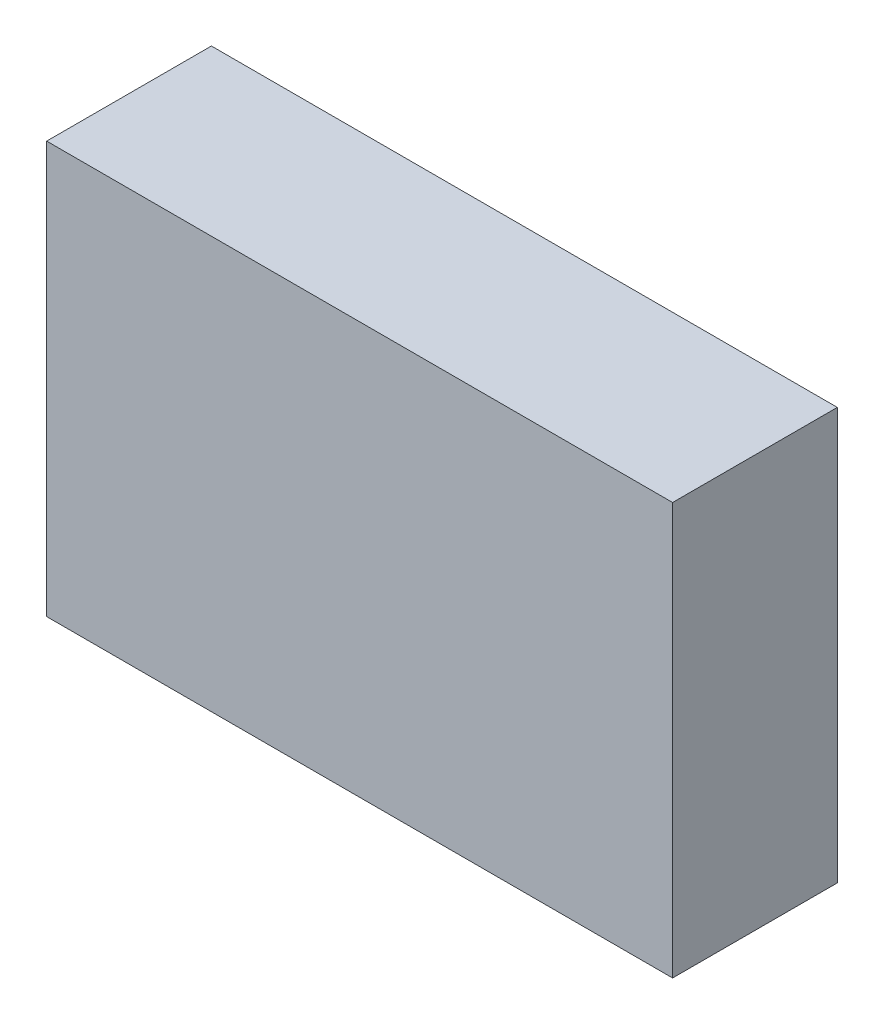
ISO-10303-21;
HEADER;
FILE_DESCRIPTION(('STEP AP214'),'2;1');
FILE_NAME('part.step','',(''),(''),'','','');
FILE_SCHEMA(('AUTOMOTIVE_DESIGN { 1 0 10303 214 1 1 1 1 }'));
ENDSEC;
DATA;
#1=APPLICATION_CONTEXT('core data for automotive mechanical design processes');
#2=APPLICATION_PROTOCOL_DEFINITION('international standard','automotive_design',2000,#1);
#3=PRODUCT_CONTEXT('',#1,'mechanical');
#4=PRODUCT('Part','Part','',(#3));
#5=PRODUCT_RELATED_PRODUCT_CATEGORY('part','',(#4));
#6=PRODUCT_DEFINITION_FORMATION('','',#4);
#7=PRODUCT_DEFINITION_CONTEXT('part definition',#1,'design');
#8=PRODUCT_DEFINITION('design','',#6,#7);
#9=PRODUCT_DEFINITION_SHAPE('','',#8);
#10=(LENGTH_UNIT() NAMED_UNIT(*) SI_UNIT(.MILLI.,.METRE.));
#11=(NAMED_UNIT(*) PLANE_ANGLE_UNIT() SI_UNIT($,.RADIAN.));
#12=(NAMED_UNIT(*) SI_UNIT($,.STERADIAN.) SOLID_ANGLE_UNIT());
#13=UNCERTAINTY_MEASURE_WITH_UNIT(LENGTH_MEASURE(1.E-05),#10,'distance_accuracy_value','');
#14=(GEOMETRIC_REPRESENTATION_CONTEXT(3) GLOBAL_UNCERTAINTY_ASSIGNED_CONTEXT((#13)) GLOBAL_UNIT_ASSIGNED_CONTEXT((#10,
#11,#12)) REPRESENTATION_CONTEXT('',''));
#15=CARTESIAN_POINT('',(0.,0.,0.));
#16=DIRECTION('',(0.,0.,1.));
#17=DIRECTION('',(1.,0.,0.));
#18=AXIS2_PLACEMENT_3D('',#15,#16,#17);
#19=CARTESIAN_POINT('',(0.,0.,0.5));
#20=DIRECTION('',(1.,0.,0.));
#21=DIRECTION('',(0.,0.,-1.));
#22=AXIS2_PLACEMENT_3D('',#19,#20,#21);
#23=PLANE('',#22);
#24=DIRECTION('',(0.,-1.,0.));
#25=VECTOR('',#24,1.);
#26=CARTESIAN_POINT('',(0.,1.25,0.));
#27=LINE('',#26,#25);
#28=CARTESIAN_POINT('',(0.,1.25,0.));
#29=VERTEX_POINT('',#28);
#30=CARTESIAN_POINT('',(0.,0.,0.));
#31=VERTEX_POINT('',#30);
#32=EDGE_CURVE('E11',#29,#31,#27,.T.);
#33=ORIENTED_EDGE('',*,*,#32,.T.);
#34=DIRECTION('',(0.,0.,-1.));
#35=VECTOR('',#34,1.);
#36=CARTESIAN_POINT('',(0.,0.,0.5));
#37=LINE('',#36,#35);
#38=CARTESIAN_POINT('',(0.,0.,0.5));
#39=VERTEX_POINT('',#38);
#40=EDGE_CURVE('E88',#39,#31,#37,.T.);
#41=ORIENTED_EDGE('',*,*,#40,.F.);
#42=DIRECTION('',(0.,-1.,0.));
#43=VECTOR('',#42,1.);
#44=CARTESIAN_POINT('',(0.,1.25,0.5));
#45=LINE('',#44,#43);
#46=CARTESIAN_POINT('',(0.,1.25,0.5));
#47=VERTEX_POINT('',#46);
#48=EDGE_CURVE('E83',#47,#39,#45,.T.);
#49=ORIENTED_EDGE('',*,*,#48,.F.);
#50=DIRECTION('',(0.,0.,-1.));
#51=VECTOR('',#50,1.);
#52=CARTESIAN_POINT('',(0.,1.25,0.5));
#53=LINE('',#52,#51);
#54=EDGE_CURVE('E72',#47,#29,#53,.T.);
#55=ORIENTED_EDGE('',*,*,#54,.T.);
#56=EDGE_LOOP('',(#33,#41,#49,#55));
#57=FACE_BOUND('',#56,.T.);
#58=ADVANCED_FACE('F17',(#57),#23,.F.);
#59=CARTESIAN_POINT('',(0.,0.,0.5));
#60=DIRECTION('',(0.,1.,0.));
#61=DIRECTION('',(0.,0.,1.));
#62=AXIS2_PLACEMENT_3D('',#59,#60,#61);
#63=PLANE('',#62);
#64=DIRECTION('',(1.,0.,0.));
#65=VECTOR('',#64,1.);
#66=CARTESIAN_POINT('',(0.,0.,0.));
#67=LINE('',#66,#65);
#68=CARTESIAN_POINT('',(1.9,0.,0.));
#69=VERTEX_POINT('',#68);
#70=EDGE_CURVE('E24',#31,#69,#67,.T.);
#71=ORIENTED_EDGE('',*,*,#70,.T.);
#72=DIRECTION('',(0.,0.,-1.));
#73=VECTOR('',#72,1.);
#74=CARTESIAN_POINT('',(1.9,0.,0.5));
#75=LINE('',#74,#73);
#76=CARTESIAN_POINT('',(1.9,0.,0.5));
#77=VERTEX_POINT('',#76);
#78=EDGE_CURVE('E85',#77,#69,#75,.T.);
#79=ORIENTED_EDGE('',*,*,#78,.F.);
#80=DIRECTION('',(1.,0.,0.));
#81=VECTOR('',#80,1.);
#82=CARTESIAN_POINT('',(0.,0.,0.5));
#83=LINE('',#82,#81);
#84=EDGE_CURVE('E66',#39,#77,#83,.T.);
#85=ORIENTED_EDGE('',*,*,#84,.F.);
#86=ORIENTED_EDGE('',*,*,#40,.T.);
#87=EDGE_LOOP('',(#71,#79,#85,#86));
#88=FACE_BOUND('',#87,.T.);
#89=ADVANCED_FACE('F89',(#88),#63,.F.);
#90=CARTESIAN_POINT('',(1.9,0.,0.5));
#91=DIRECTION('',(-1.,0.,0.));
#92=DIRECTION('',(0.,0.,1.));
#93=AXIS2_PLACEMENT_3D('',#90,#91,#92);
#94=PLANE('',#93);
#95=DIRECTION('',(0.,1.,0.));
#96=VECTOR('',#95,1.);
#97=CARTESIAN_POINT('',(1.9,0.,0.));
#98=LINE('',#97,#96);
#99=CARTESIAN_POINT('',(1.9,1.25,0.));
#100=VERTEX_POINT('',#99);
#101=EDGE_CURVE('E62',#69,#100,#98,.T.);
#102=ORIENTED_EDGE('',*,*,#101,.T.);
#103=DIRECTION('',(0.,0.,-1.));
#104=VECTOR('',#103,1.);
#105=CARTESIAN_POINT('',(1.9,1.25,0.5));
#106=LINE('',#105,#104);
#107=CARTESIAN_POINT('',(1.9,1.25,0.5));
#108=VERTEX_POINT('',#107);
#109=EDGE_CURVE('E55',#108,#100,#106,.T.);
#110=ORIENTED_EDGE('',*,*,#109,.F.);
#111=DIRECTION('',(0.,1.,0.));
#112=VECTOR('',#111,1.);
#113=CARTESIAN_POINT('',(1.9,0.,0.5));
#114=LINE('',#113,#112);
#115=EDGE_CURVE('E59',#77,#108,#114,.T.);
#116=ORIENTED_EDGE('',*,*,#115,.F.);
#117=ORIENTED_EDGE('',*,*,#78,.T.);
#118=EDGE_LOOP('',(#102,#110,#116,#117));
#119=FACE_BOUND('',#118,.T.);
#120=ADVANCED_FACE('F57',(#119),#94,.F.);
#121=CARTESIAN_POINT('',(0.,1.25,0.5));
#122=DIRECTION('',(0.,-1.,0.));
#123=DIRECTION('',(0.,0.,-1.));
#124=AXIS2_PLACEMENT_3D('',#121,#122,#123);
#125=PLANE('',#124);
#126=DIRECTION('',(-1.,0.,0.));
#127=VECTOR('',#126,1.);
#128=CARTESIAN_POINT('',(1.9,1.25,0.));
#129=LINE('',#128,#127);
#130=EDGE_CURVE('E65',#100,#29,#129,.T.);
#131=ORIENTED_EDGE('',*,*,#130,.T.);
#132=ORIENTED_EDGE('',*,*,#54,.F.);
#133=DIRECTION('',(-1.,0.,0.));
#134=VECTOR('',#133,1.);
#135=CARTESIAN_POINT('',(1.9,1.25,0.5));
#136=LINE('',#135,#134);
#137=EDGE_CURVE('E70',#108,#47,#136,.T.);
#138=ORIENTED_EDGE('',*,*,#137,.F.);
#139=ORIENTED_EDGE('',*,*,#109,.T.);
#140=EDGE_LOOP('',(#131,#132,#138,#139));
#141=FACE_BOUND('',#140,.T.);
#142=ADVANCED_FACE('F71',(#141),#125,.F.);
#143=CARTESIAN_POINT('',(0.,0.,0.5));
#144=DIRECTION('',(0.,0.,-1.));
#145=DIRECTION('',(-1.,0.,0.));
#146=AXIS2_PLACEMENT_3D('',#143,#144,#145);
#147=PLANE('',#146);
#148=ORIENTED_EDGE('',*,*,#48,.T.);
#149=ORIENTED_EDGE('',*,*,#84,.T.);
#150=ORIENTED_EDGE('',*,*,#115,.T.);
#151=ORIENTED_EDGE('',*,*,#137,.T.);
#152=EDGE_LOOP('',(#148,#149,#150,#151));
#153=FACE_BOUND('',#152,.T.);
#154=ADVANCED_FACE('F76',(#153),#147,.F.);
#155=CARTESIAN_POINT('',(0.,0.,0.));
#156=DIRECTION('',(0.,0.,-1.));
#157=DIRECTION('',(-1.,0.,0.));
#158=AXIS2_PLACEMENT_3D('',#155,#156,#157);
#159=PLANE('',#158);
#160=ORIENTED_EDGE('',*,*,#32,.F.);
#161=ORIENTED_EDGE('',*,*,#130,.F.);
#162=ORIENTED_EDGE('',*,*,#101,.F.);
#163=ORIENTED_EDGE('',*,*,#70,.F.);
#164=EDGE_LOOP('',(#160,#161,#162,#163));
#165=FACE_BOUND('',#164,.T.);
#166=ADVANCED_FACE('F91',(#165),#159,.T.);
#167=CLOSED_SHELL('',(#58,#89,#120,#142,#154,#166));
#168=MANIFOLD_SOLID_BREP('B1',#167);
#169=ADVANCED_BREP_SHAPE_REPRESENTATION('',(#18,#168),#14);
#170=SHAPE_DEFINITION_REPRESENTATION(#9,#169);
ENDSEC;
END-ISO-10303-21;
